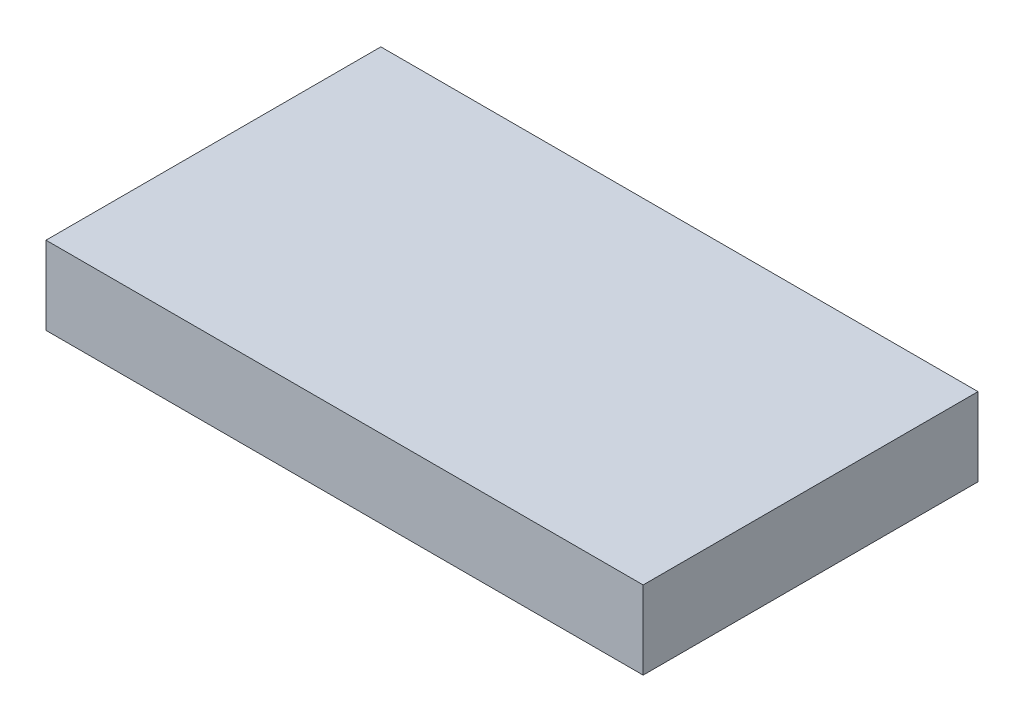
ISO-10303-21;
HEADER;
FILE_DESCRIPTION(('STEP AP214'),'2;1');
FILE_NAME('part.step','',(''),(''),'','','');
FILE_SCHEMA(('AUTOMOTIVE_DESIGN { 1 0 10303 214 1 1 1 1 }'));
ENDSEC;
DATA;
#1=APPLICATION_CONTEXT('core data for automotive mechanical design processes');
#2=APPLICATION_PROTOCOL_DEFINITION('international standard','automotive_design',2000,#1);
#3=PRODUCT_CONTEXT('',#1,'mechanical');
#4=PRODUCT('Part','Part','',(#3));
#5=PRODUCT_RELATED_PRODUCT_CATEGORY('part','',(#4));
#6=PRODUCT_DEFINITION_FORMATION('','',#4);
#7=PRODUCT_DEFINITION_CONTEXT('part definition',#1,'design');
#8=PRODUCT_DEFINITION('design','',#6,#7);
#9=PRODUCT_DEFINITION_SHAPE('','',#8);
#10=(LENGTH_UNIT() NAMED_UNIT(*) SI_UNIT(.MILLI.,.METRE.));
#11=(NAMED_UNIT(*) PLANE_ANGLE_UNIT() SI_UNIT($,.RADIAN.));
#12=(NAMED_UNIT(*) SI_UNIT($,.STERADIAN.) SOLID_ANGLE_UNIT());
#13=UNCERTAINTY_MEASURE_WITH_UNIT(LENGTH_MEASURE(1.E-05),#10,'distance_accuracy_value','');
#14=(GEOMETRIC_REPRESENTATION_CONTEXT(3) GLOBAL_UNCERTAINTY_ASSIGNED_CONTEXT((#13)) GLOBAL_UNIT_ASSIGNED_CONTEXT((#10,
#11,#12)) REPRESENTATION_CONTEXT('',''));
#15=CARTESIAN_POINT('',(0.,0.,0.));
#16=DIRECTION('',(0.,0.,1.));
#17=DIRECTION('',(1.,0.,0.));
#18=AXIS2_PLACEMENT_3D('',#15,#16,#17);
#19=CARTESIAN_POINT('',(0.,7.,0.));
#20=DIRECTION('',(-1.,0.,0.));
#21=DIRECTION('',(0.,0.,1.));
#22=AXIS2_PLACEMENT_3D('',#19,#20,#21);
#23=PLANE('',#22);
#24=DIRECTION('',(0.,0.,-1.));
#25=VECTOR('',#24,1.);
#26=CARTESIAN_POINT('',(0.,0.,0.));
#27=LINE('',#26,#25);
#28=CARTESIAN_POINT('',(0.,0.,30.));
#29=VERTEX_POINT('',#28);
#30=CARTESIAN_POINT('',(0.,0.,0.));
#31=VERTEX_POINT('',#30);
#32=EDGE_CURVE('E95',#29,#31,#27,.T.);
#33=ORIENTED_EDGE('',*,*,#32,.T.);
#34=DIRECTION('',(0.,-1.,0.));
#35=VECTOR('',#34,1.);
#36=CARTESIAN_POINT('',(0.,7.,0.));
#37=LINE('',#36,#35);
#38=CARTESIAN_POINT('',(0.,7.,0.));
#39=VERTEX_POINT('',#38);
#40=EDGE_CURVE('E11',#39,#31,#37,.T.);
#41=ORIENTED_EDGE('',*,*,#40,.F.);
#42=DIRECTION('',(0.,0.,-1.));
#43=VECTOR('',#42,1.);
#44=CARTESIAN_POINT('',(0.,7.,0.));
#45=LINE('',#44,#43);
#46=CARTESIAN_POINT('',(0.,7.,30.));
#47=VERTEX_POINT('',#46);
#48=EDGE_CURVE('E83',#47,#39,#45,.T.);
#49=ORIENTED_EDGE('',*,*,#48,.F.);
#50=DIRECTION('',(0.,-1.,0.));
#51=VECTOR('',#50,1.);
#52=CARTESIAN_POINT('',(0.,7.,30.));
#53=LINE('',#52,#51);
#54=EDGE_CURVE('E91',#47,#29,#53,.T.);
#55=ORIENTED_EDGE('',*,*,#54,.T.);
#56=EDGE_LOOP('',(#33,#41,#49,#55));
#57=FACE_BOUND('',#56,.T.);
#58=ADVANCED_FACE('F32',(#57),#23,.F.);
#59=CARTESIAN_POINT('',(0.,7.,0.));
#60=DIRECTION('',(0.,0.,1.));
#61=DIRECTION('',(1.,0.,0.));
#62=AXIS2_PLACEMENT_3D('',#59,#60,#61);
#63=PLANE('',#62);
#64=DIRECTION('',(-1.,0.,0.));
#65=VECTOR('',#64,1.);
#66=CARTESIAN_POINT('',(0.,0.,0.));
#67=LINE('',#66,#65);
#68=CARTESIAN_POINT('',(-53.5,0.,0.));
#69=VERTEX_POINT('',#68);
#70=EDGE_CURVE('E87',#31,#69,#67,.T.);
#71=ORIENTED_EDGE('',*,*,#70,.T.);
#72=DIRECTION('',(0.,-1.,0.));
#73=VECTOR('',#72,1.);
#74=CARTESIAN_POINT('',(-53.5,7.,0.));
#75=LINE('',#74,#73);
#76=CARTESIAN_POINT('',(-53.5,7.,0.));
#77=VERTEX_POINT('',#76);
#78=EDGE_CURVE('E40',#77,#69,#75,.T.);
#79=ORIENTED_EDGE('',*,*,#78,.F.);
#80=DIRECTION('',(-1.,0.,0.));
#81=VECTOR('',#80,1.);
#82=CARTESIAN_POINT('',(0.,7.,0.));
#83=LINE('',#82,#81);
#84=EDGE_CURVE('E78',#39,#77,#83,.T.);
#85=ORIENTED_EDGE('',*,*,#84,.F.);
#86=ORIENTED_EDGE('',*,*,#40,.T.);
#87=EDGE_LOOP('',(#71,#79,#85,#86));
#88=FACE_BOUND('',#87,.T.);
#89=ADVANCED_FACE('F86',(#88),#63,.F.);
#90=CARTESIAN_POINT('',(-53.5,7.,0.));
#91=DIRECTION('',(1.,0.,0.));
#92=DIRECTION('',(0.,0.,-1.));
#93=AXIS2_PLACEMENT_3D('',#90,#91,#92);
#94=PLANE('',#93);
#95=DIRECTION('',(0.,0.,1.));
#96=VECTOR('',#95,1.);
#97=CARTESIAN_POINT('',(-53.5,0.,0.));
#98=LINE('',#97,#96);
#99=CARTESIAN_POINT('',(-53.5,0.,30.));
#100=VERTEX_POINT('',#99);
#101=EDGE_CURVE('E65',#69,#100,#98,.T.);
#102=ORIENTED_EDGE('',*,*,#101,.T.);
#103=DIRECTION('',(0.,-1.,0.));
#104=VECTOR('',#103,1.);
#105=CARTESIAN_POINT('',(-53.5,7.,30.));
#106=LINE('',#105,#104);
#107=CARTESIAN_POINT('',(-53.5,7.,30.));
#108=VERTEX_POINT('',#107);
#109=EDGE_CURVE('E88',#108,#100,#106,.T.);
#110=ORIENTED_EDGE('',*,*,#109,.F.);
#111=DIRECTION('',(0.,0.,1.));
#112=VECTOR('',#111,1.);
#113=CARTESIAN_POINT('',(-53.5,7.,0.));
#114=LINE('',#113,#112);
#115=EDGE_CURVE('E81',#77,#108,#114,.T.);
#116=ORIENTED_EDGE('',*,*,#115,.F.);
#117=ORIENTED_EDGE('',*,*,#78,.T.);
#118=EDGE_LOOP('',(#102,#110,#116,#117));
#119=FACE_BOUND('',#118,.T.);
#120=ADVANCED_FACE('F89',(#119),#94,.F.);
#121=CARTESIAN_POINT('',(0.,7.,30.));
#122=DIRECTION('',(0.,0.,-1.));
#123=DIRECTION('',(-1.,0.,0.));
#124=AXIS2_PLACEMENT_3D('',#121,#122,#123);
#125=PLANE('',#124);
#126=DIRECTION('',(1.,0.,0.));
#127=VECTOR('',#126,1.);
#128=CARTESIAN_POINT('',(0.,0.,30.));
#129=LINE('',#128,#127);
#130=EDGE_CURVE('E71',#100,#29,#129,.T.);
#131=ORIENTED_EDGE('',*,*,#130,.T.);
#132=ORIENTED_EDGE('',*,*,#54,.F.);
#133=DIRECTION('',(1.,0.,0.));
#134=VECTOR('',#133,1.);
#135=CARTESIAN_POINT('',(0.,7.,30.));
#136=LINE('',#135,#134);
#137=EDGE_CURVE('E48',#108,#47,#136,.T.);
#138=ORIENTED_EDGE('',*,*,#137,.F.);
#139=ORIENTED_EDGE('',*,*,#109,.T.);
#140=EDGE_LOOP('',(#131,#132,#138,#139));
#141=FACE_BOUND('',#140,.T.);
#142=ADVANCED_FACE('F102',(#141),#125,.F.);
#143=CARTESIAN_POINT('',(0.,7.,0.));
#144=DIRECTION('',(0.,-1.,0.));
#145=DIRECTION('',(0.,0.,-1.));
#146=AXIS2_PLACEMENT_3D('',#143,#144,#145);
#147=PLANE('',#146);
#148=ORIENTED_EDGE('',*,*,#48,.T.);
#149=ORIENTED_EDGE('',*,*,#84,.T.);
#150=ORIENTED_EDGE('',*,*,#115,.T.);
#151=ORIENTED_EDGE('',*,*,#137,.T.);
#152=EDGE_LOOP('',(#148,#149,#150,#151));
#153=FACE_BOUND('',#152,.T.);
#154=ADVANCED_FACE('F79',(#153),#147,.F.);
#155=CARTESIAN_POINT('',(0.,0.,0.));
#156=DIRECTION('',(0.,-1.,0.));
#157=DIRECTION('',(0.,0.,-1.));
#158=AXIS2_PLACEMENT_3D('',#155,#156,#157);
#159=PLANE('',#158);
#160=ORIENTED_EDGE('',*,*,#32,.F.);
#161=ORIENTED_EDGE('',*,*,#130,.F.);
#162=ORIENTED_EDGE('',*,*,#101,.F.);
#163=ORIENTED_EDGE('',*,*,#70,.F.);
#164=EDGE_LOOP('',(#160,#161,#162,#163));
#165=FACE_BOUND('',#164,.T.);
#166=ADVANCED_FACE('F105',(#165),#159,.T.);
#167=CLOSED_SHELL('',(#58,#89,#120,#142,#154,#166));
#168=MANIFOLD_SOLID_BREP('B2',#167);
#169=ADVANCED_BREP_SHAPE_REPRESENTATION('',(#18,#168),#14);
#170=SHAPE_DEFINITION_REPRESENTATION(#9,#169);
ENDSEC;
END-ISO-10303-21;
